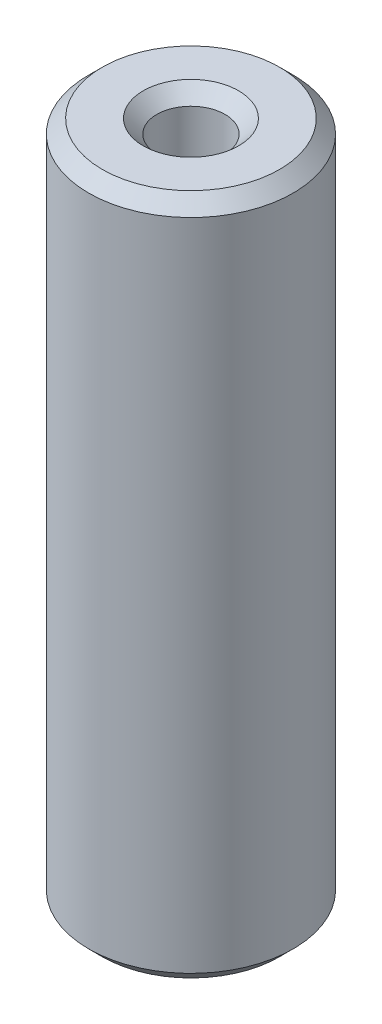
ISO-10303-21;
HEADER;
FILE_DESCRIPTION(('STEP AP214'),'2;1');
FILE_NAME('part.step','',(''),(''),'','','');
FILE_SCHEMA(('AUTOMOTIVE_DESIGN { 1 0 10303 214 1 1 1 1 }'));
ENDSEC;
DATA;
#1=APPLICATION_CONTEXT('core data for automotive mechanical design processes');
#2=APPLICATION_PROTOCOL_DEFINITION('international standard','automotive_design',2000,#1);
#3=PRODUCT_CONTEXT('',#1,'mechanical');
#4=PRODUCT('Part','Part','',(#3));
#5=PRODUCT_RELATED_PRODUCT_CATEGORY('part','',(#4));
#6=PRODUCT_DEFINITION_FORMATION('','',#4);
#7=PRODUCT_DEFINITION_CONTEXT('part definition',#1,'design');
#8=PRODUCT_DEFINITION('design','',#6,#7);
#9=PRODUCT_DEFINITION_SHAPE('','',#8);
#10=(LENGTH_UNIT() NAMED_UNIT(*) SI_UNIT(.MILLI.,.METRE.));
#11=(NAMED_UNIT(*) PLANE_ANGLE_UNIT() SI_UNIT($,.RADIAN.));
#12=(NAMED_UNIT(*) SI_UNIT($,.STERADIAN.) SOLID_ANGLE_UNIT());
#13=UNCERTAINTY_MEASURE_WITH_UNIT(LENGTH_MEASURE(1.E-05),#10,'distance_accuracy_value','');
#14=(GEOMETRIC_REPRESENTATION_CONTEXT(3) GLOBAL_UNCERTAINTY_ASSIGNED_CONTEXT((#13)) GLOBAL_UNIT_ASSIGNED_CONTEXT((#10,
#11,#12)) REPRESENTATION_CONTEXT('',''));
#15=CARTESIAN_POINT('',(0.,0.,0.));
#16=DIRECTION('',(0.,0.,1.));
#17=DIRECTION('',(1.,0.,0.));
#18=AXIS2_PLACEMENT_3D('',#15,#16,#17);
#19=CARTESIAN_POINT('',(0.,50.,0.));
#20=DIRECTION('',(0.,1.,0.));
#21=DIRECTION('',(0.,0.,1.));
#22=AXIS2_PLACEMENT_3D('',#19,#20,#21);
#23=PLANE('',#22);
#24=CARTESIAN_POINT('',(0.,50.,0.));
#25=DIRECTION('',(0.,1.,0.));
#26=DIRECTION('',(0.,0.,1.));
#27=AXIS2_PLACEMENT_3D('',#24,#25,#26);
#28=CIRCLE('',#27,3.50000000000001);
#29=CARTESIAN_POINT('',(0.,50.,3.50000000000001));
#30=VERTEX_POINT('',#29);
#31=EDGE_CURVE('E10',#30,#30,#28,.F.);
#32=ORIENTED_EDGE('',*,*,#31,.T.);
#33=EDGE_LOOP('',(#32));
#34=FACE_BOUND('',#33,.T.);
#35=CARTESIAN_POINT('',(0.,50.,0.));
#36=DIRECTION('',(0.,1.,0.));
#37=DIRECTION('',(0.,0.,1.));
#38=AXIS2_PLACEMENT_3D('',#35,#36,#37);
#39=CIRCLE('',#38,6.49999999999999);
#40=CARTESIAN_POINT('',(0.,50.,6.49999999999999));
#41=VERTEX_POINT('',#40);
#42=EDGE_CURVE('E36',#41,#41,#39,.T.);
#43=ORIENTED_EDGE('',*,*,#42,.T.);
#44=EDGE_LOOP('',(#43));
#45=FACE_BOUND('',#44,.T.);
#46=ADVANCED_FACE('F29',(#34,#45),#23,.T.);
#47=CARTESIAN_POINT('',(0.,0.,0.));
#48=DIRECTION('',(0.,1.,0.));
#49=DIRECTION('',(0.,0.,1.));
#50=AXIS2_PLACEMENT_3D('',#47,#48,#49);
#51=PLANE('',#50);
#52=CARTESIAN_POINT('',(0.,0.,0.));
#53=DIRECTION('',(0.,1.,0.));
#54=DIRECTION('',(0.,0.,1.));
#55=AXIS2_PLACEMENT_3D('',#52,#53,#54);
#56=CIRCLE('',#55,3.5);
#57=CARTESIAN_POINT('',(0.,0.,3.5));
#58=VERTEX_POINT('',#57);
#59=EDGE_CURVE('E55',#58,#58,#56,.T.);
#60=ORIENTED_EDGE('',*,*,#59,.T.);
#61=EDGE_LOOP('',(#60));
#62=FACE_BOUND('',#61,.T.);
#63=CARTESIAN_POINT('',(0.,0.,0.));
#64=DIRECTION('',(0.,1.,0.));
#65=DIRECTION('',(0.,0.,1.));
#66=AXIS2_PLACEMENT_3D('',#63,#64,#65);
#67=CIRCLE('',#66,6.49999999999999);
#68=CARTESIAN_POINT('',(0.,0.,6.49999999999999));
#69=VERTEX_POINT('',#68);
#70=EDGE_CURVE('E58',#69,#69,#67,.F.);
#71=ORIENTED_EDGE('',*,*,#70,.T.);
#72=EDGE_LOOP('',(#71));
#73=FACE_BOUND('',#72,.T.);
#74=ADVANCED_FACE('F62',(#62,#73),#51,.F.);
#75=CARTESIAN_POINT('',(0.,50.,0.));
#76=DIRECTION('',(0.,-1.,0.));
#77=DIRECTION('',(0.,0.,-1.));
#78=AXIS2_PLACEMENT_3D('',#75,#76,#77);
#79=CYLINDRICAL_SURFACE('',#78,7.5);
#80=CARTESIAN_POINT('',(0.,0.999999999999994,0.));
#81=DIRECTION('',(0.,1.,0.));
#82=DIRECTION('',(0.,0.,1.));
#83=AXIS2_PLACEMENT_3D('',#80,#81,#82);
#84=CIRCLE('',#83,7.5);
#85=CARTESIAN_POINT('',(0.,0.999999999999994,7.5));
#86=VERTEX_POINT('',#85);
#87=EDGE_CURVE('E40',#86,#86,#84,.T.);
#88=ORIENTED_EDGE('',*,*,#87,.T.);
#89=EDGE_LOOP('',(#88));
#90=FACE_BOUND('',#89,.T.);
#91=CARTESIAN_POINT('',(0.,49.,0.));
#92=DIRECTION('',(0.,1.,0.));
#93=DIRECTION('',(0.,0.,1.));
#94=AXIS2_PLACEMENT_3D('',#91,#92,#93);
#95=CIRCLE('',#94,7.5);
#96=CARTESIAN_POINT('',(0.,49.,7.5));
#97=VERTEX_POINT('',#96);
#98=EDGE_CURVE('E44',#97,#97,#95,.F.);
#99=ORIENTED_EDGE('',*,*,#98,.T.);
#100=EDGE_LOOP('',(#99));
#101=FACE_BOUND('',#100,.T.);
#102=ADVANCED_FACE('F72',(#90,#101),#79,.T.);
#103=CARTESIAN_POINT('',(0.,50.,0.));
#104=DIRECTION('',(0.,-1.,0.));
#105=DIRECTION('',(0.,0.,-1.));
#106=AXIS2_PLACEMENT_3D('',#103,#104,#105);
#107=CYLINDRICAL_SURFACE('',#106,2.5);
#108=CARTESIAN_POINT('',(0.,1.00000000000001,0.));
#109=DIRECTION('',(0.,1.,0.));
#110=DIRECTION('',(0.,0.,1.));
#111=AXIS2_PLACEMENT_3D('',#108,#109,#110);
#112=CIRCLE('',#111,2.5);
#113=CARTESIAN_POINT('',(0.,1.00000000000001,2.5));
#114=VERTEX_POINT('',#113);
#115=EDGE_CURVE('E49',#114,#114,#112,.F.);
#116=ORIENTED_EDGE('',*,*,#115,.T.);
#117=EDGE_LOOP('',(#116));
#118=FACE_BOUND('',#117,.T.);
#119=CARTESIAN_POINT('',(0.,49.,0.));
#120=DIRECTION('',(0.,1.,0.));
#121=DIRECTION('',(0.,0.,1.));
#122=AXIS2_PLACEMENT_3D('',#119,#120,#121);
#123=CIRCLE('',#122,2.5);
#124=CARTESIAN_POINT('',(0.,49.,2.5));
#125=VERTEX_POINT('',#124);
#126=EDGE_CURVE('E52',#125,#125,#123,.T.);
#127=ORIENTED_EDGE('',*,*,#126,.T.);
#128=EDGE_LOOP('',(#127));
#129=FACE_BOUND('',#128,.T.);
#130=ADVANCED_FACE('F75',(#118,#129),#107,.F.);
#131=CARTESIAN_POINT('',(0.,0.,0.));
#132=DIRECTION('',(0.,-1.,0.));
#133=DIRECTION('',(0.,0.,-1.));
#134=AXIS2_PLACEMENT_3D('',#131,#132,#133);
#135=CONICAL_SURFACE('',#134,3.5,0.785398163397446);
#136=ORIENTED_EDGE('',*,*,#115,.F.);
#137=EDGE_LOOP('',(#136));
#138=FACE_BOUND('',#137,.T.);
#139=ORIENTED_EDGE('',*,*,#59,.F.);
#140=EDGE_LOOP('',(#139));
#141=FACE_BOUND('',#140,.T.);
#142=ADVANCED_FACE('F68',(#138,#141),#135,.F.);
#143=CARTESIAN_POINT('',(0.,0.999999999999994,0.));
#144=DIRECTION('',(0.,1.,0.));
#145=DIRECTION('',(0.,0.,1.));
#146=AXIS2_PLACEMENT_3D('',#143,#144,#145);
#147=CONICAL_SURFACE('',#146,7.5,0.785398163397455);
#148=ORIENTED_EDGE('',*,*,#70,.F.);
#149=EDGE_LOOP('',(#148));
#150=FACE_BOUND('',#149,.T.);
#151=ORIENTED_EDGE('',*,*,#87,.F.);
#152=EDGE_LOOP('',(#151));
#153=FACE_BOUND('',#152,.T.);
#154=ADVANCED_FACE('F64',(#150,#153),#147,.T.);
#155=CARTESIAN_POINT('',(0.,49.,0.));
#156=DIRECTION('',(0.,1.,0.));
#157=DIRECTION('',(0.,0.,1.));
#158=AXIS2_PLACEMENT_3D('',#155,#156,#157);
#159=CONICAL_SURFACE('',#158,2.5,0.785398163397453);
#160=ORIENTED_EDGE('',*,*,#31,.F.);
#161=EDGE_LOOP('',(#160));
#162=FACE_BOUND('',#161,.T.);
#163=ORIENTED_EDGE('',*,*,#126,.F.);
#164=EDGE_LOOP('',(#163));
#165=FACE_BOUND('',#164,.T.);
#166=ADVANCED_FACE('F67',(#162,#165),#159,.F.);
#167=CARTESIAN_POINT('',(0.,50.,0.));
#168=DIRECTION('',(0.,-1.,0.));
#169=DIRECTION('',(0.,0.,-1.));
#170=AXIS2_PLACEMENT_3D('',#167,#168,#169);
#171=CONICAL_SURFACE('',#170,6.49999999999999,0.785398163397445);
#172=ORIENTED_EDGE('',*,*,#98,.F.);
#173=EDGE_LOOP('',(#172));
#174=FACE_BOUND('',#173,.T.);
#175=ORIENTED_EDGE('',*,*,#42,.F.);
#176=EDGE_LOOP('',(#175));
#177=FACE_BOUND('',#176,.T.);
#178=ADVANCED_FACE('F31',(#174,#177),#171,.T.);
#179=CLOSED_SHELL('',(#46,#74,#102,#130,#142,#154,#166,#178));
#180=MANIFOLD_SOLID_BREP('B2',#179);
#181=ADVANCED_BREP_SHAPE_REPRESENTATION('',(#18,#180),#14);
#182=SHAPE_DEFINITION_REPRESENTATION(#9,#181);
ENDSEC;
END-ISO-10303-21;
